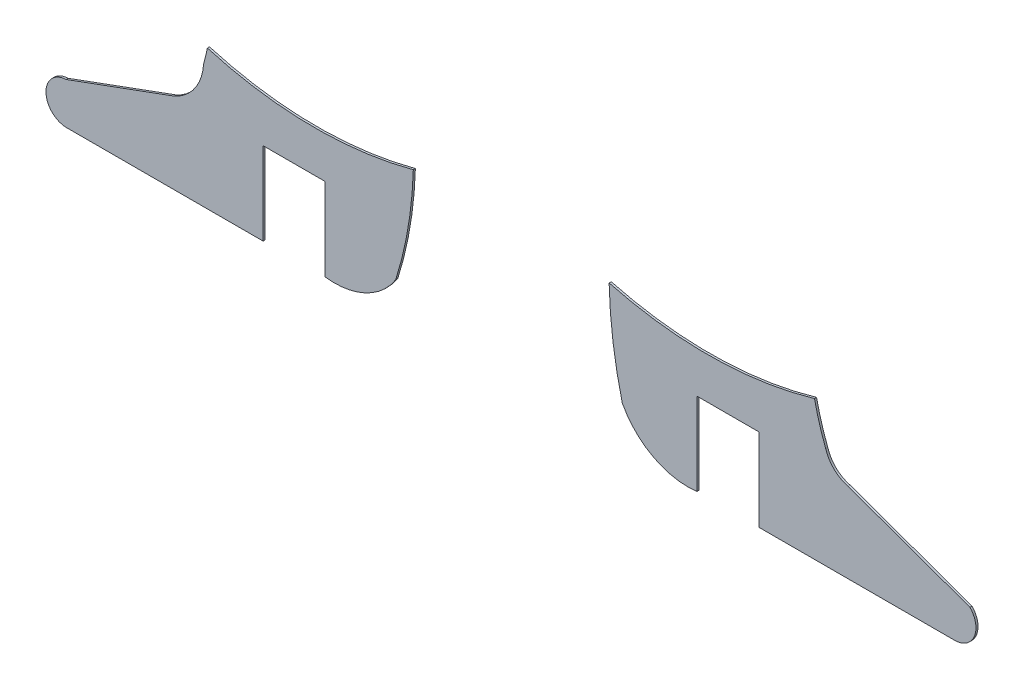
ISO-10303-21;
HEADER;
FILE_DESCRIPTION(('STEP AP214'),'2;1');
FILE_NAME('part.step','',(''),(''),'','','');
FILE_SCHEMA(('AUTOMOTIVE_DESIGN { 1 0 10303 214 1 1 1 1 }'));
ENDSEC;
DATA;
#1=APPLICATION_CONTEXT('core data for automotive mechanical design processes');
#2=APPLICATION_PROTOCOL_DEFINITION('international standard','automotive_design',2000,#1);
#3=PRODUCT_CONTEXT('',#1,'mechanical');
#4=PRODUCT('Part','Part','',(#3));
#5=PRODUCT_RELATED_PRODUCT_CATEGORY('part','',(#4));
#6=PRODUCT_DEFINITION_FORMATION('','',#4);
#7=PRODUCT_DEFINITION_CONTEXT('part definition',#1,'design');
#8=PRODUCT_DEFINITION('design','',#6,#7);
#9=PRODUCT_DEFINITION_SHAPE('','',#8);
#10=(LENGTH_UNIT() NAMED_UNIT(*) SI_UNIT(.MILLI.,.METRE.));
#11=(NAMED_UNIT(*) PLANE_ANGLE_UNIT() SI_UNIT($,.RADIAN.));
#12=(NAMED_UNIT(*) SI_UNIT($,.STERADIAN.) SOLID_ANGLE_UNIT());
#13=UNCERTAINTY_MEASURE_WITH_UNIT(LENGTH_MEASURE(1.E-05),#10,'distance_accuracy_value','');
#14=(GEOMETRIC_REPRESENTATION_CONTEXT(3) GLOBAL_UNCERTAINTY_ASSIGNED_CONTEXT((#13)) GLOBAL_UNIT_ASSIGNED_CONTEXT((#10,
#11,#12)) REPRESENTATION_CONTEXT('',''));
#15=CARTESIAN_POINT('',(0.,0.,0.));
#16=DIRECTION('',(0.,0.,1.));
#17=DIRECTION('',(1.,0.,0.));
#18=AXIS2_PLACEMENT_3D('',#15,#16,#17);
#19=CARTESIAN_POINT('',(83.8690290709745,20.8495485557272,0.1));
#20=DIRECTION('',(0.,0.,-1.));
#21=DIRECTION('',(-1.,0.,0.));
#22=AXIS2_PLACEMENT_3D('',#19,#20,#21);
#23=CYLINDRICAL_SURFACE('',#22,12.4573303817105);
#24=CARTESIAN_POINT('',(83.8690290709745,20.8495485557272,0.));
#25=DIRECTION('',(0.,0.,-1.));
#26=DIRECTION('',(1.,0.,0.));
#27=AXIS2_PLACEMENT_3D('',#24,#25,#26);
#28=CIRCLE('',#27,12.4573303817105);
#29=CARTESIAN_POINT('',(72.2341393791567,16.3982091956784,0.));
#30=VERTEX_POINT('',#29);
#31=CARTESIAN_POINT('',(71.6914335518957,18.2244299654919,0.));
#32=VERTEX_POINT('',#31);
#33=EDGE_CURVE('E157',#30,#32,#28,.T.);
#34=ORIENTED_EDGE('',*,*,#33,.T.);
#35=DIRECTION('',(0.,0.,-1.));
#36=VECTOR('',#35,1.);
#37=CARTESIAN_POINT('',(71.6914335518957,18.2244299654919,0.1));
#38=LINE('',#37,#36);
#39=CARTESIAN_POINT('',(71.6914335518957,18.2244299654919,0.1));
#40=VERTEX_POINT('',#39);
#41=EDGE_CURVE('E12',#40,#32,#38,.T.);
#42=ORIENTED_EDGE('',*,*,#41,.F.);
#43=CARTESIAN_POINT('',(83.8690290709745,20.8495485557272,0.1));
#44=DIRECTION('',(0.,0.,-1.));
#45=DIRECTION('',(1.,0.,0.));
#46=AXIS2_PLACEMENT_3D('',#43,#44,#45);
#47=CIRCLE('',#46,12.4573303817105);
#48=CARTESIAN_POINT('',(72.2341393791567,16.3982091956784,0.1));
#49=VERTEX_POINT('',#48);
#50=EDGE_CURVE('E177',#49,#40,#47,.T.);
#51=ORIENTED_EDGE('',*,*,#50,.F.);
#52=DIRECTION('',(0.,0.,-1.));
#53=VECTOR('',#52,1.);
#54=CARTESIAN_POINT('',(72.2341393791567,16.3982091956784,0.1));
#55=LINE('',#54,#53);
#56=EDGE_CURVE('E153',#49,#30,#55,.T.);
#57=ORIENTED_EDGE('',*,*,#56,.T.);
#58=EDGE_LOOP('',(#34,#42,#51,#57));
#59=FACE_BOUND('',#58,.T.);
#60=ADVANCED_FACE('F43',(#59),#23,.F.);
#61=CARTESIAN_POINT('',(66.5013865734847,35.9814965126974,0.1));
#62=DIRECTION('',(0.,0.,-1.));
#63=DIRECTION('',(-1.,0.,0.));
#64=AXIS2_PLACEMENT_3D('',#61,#62,#63);
#65=CYLINDRICAL_SURFACE('',#64,18.4999999999999);
#66=CARTESIAN_POINT('',(66.5013865734847,35.9814965126974,0.));
#67=DIRECTION('',(0.,0.,-1.));
#68=DIRECTION('',(1.,0.,0.));
#69=AXIS2_PLACEMENT_3D('',#66,#67,#68);
#70=CIRCLE('',#69,18.4999999999999);
#71=CARTESIAN_POINT('',(61.7511875133705,18.1017423508168,0.));
#72=VERTEX_POINT('',#71);
#73=EDGE_CURVE('E160',#32,#72,#70,.T.);
#74=ORIENTED_EDGE('',*,*,#73,.T.);
#75=DIRECTION('',(0.,0.,-1.));
#76=VECTOR('',#75,1.);
#77=CARTESIAN_POINT('',(61.7511875133705,18.1017423508168,0.1));
#78=LINE('',#77,#76);
#79=CARTESIAN_POINT('',(61.7511875133705,18.1017423508168,0.1));
#80=VERTEX_POINT('',#79);
#81=EDGE_CURVE('E51',#80,#72,#78,.T.);
#82=ORIENTED_EDGE('',*,*,#81,.F.);
#83=CARTESIAN_POINT('',(66.5013865734847,35.9814965126974,0.1));
#84=DIRECTION('',(0.,0.,-1.));
#85=DIRECTION('',(1.,0.,0.));
#86=AXIS2_PLACEMENT_3D('',#83,#84,#85);
#87=CIRCLE('',#86,18.4999999999999);
#88=EDGE_CURVE('E111',#40,#80,#87,.T.);
#89=ORIENTED_EDGE('',*,*,#88,.F.);
#90=ORIENTED_EDGE('',*,*,#41,.T.);
#91=EDGE_LOOP('',(#74,#82,#89,#90));
#92=FACE_BOUND('',#91,.T.);
#93=ADVANCED_FACE('F249',(#92),#65,.F.);
#94=CARTESIAN_POINT('',(83.1721964305058,18.5925598102936,0.1));
#95=DIRECTION('',(0.,0.,-1.));
#96=DIRECTION('',(-1.,0.,0.));
#97=AXIS2_PLACEMENT_3D('',#94,#95,#96);
#98=CYLINDRICAL_SURFACE('',#97,21.4266312052669);
#99=CARTESIAN_POINT('',(83.1721964305058,18.5925598102936,0.));
#100=DIRECTION('',(0.,0.,1.));
#101=DIRECTION('',(1.,0.,0.));
#102=AXIS2_PLACEMENT_3D('',#99,#100,#101);
#103=CIRCLE('',#102,21.4266312052669);
#104=CARTESIAN_POINT('',(62.3891769458998,13.3803984631168,0.));
#105=VERTEX_POINT('',#104);
#106=EDGE_CURVE('E162',#72,#105,#103,.T.);
#107=ORIENTED_EDGE('',*,*,#106,.T.);
#108=DIRECTION('',(0.,0.,-1.));
#109=VECTOR('',#108,1.);
#110=CARTESIAN_POINT('',(62.3891769458998,13.3803984631168,0.1));
#111=LINE('',#110,#109);
#112=CARTESIAN_POINT('',(62.3891769458998,13.3803984631168,0.1));
#113=VERTEX_POINT('',#112);
#114=EDGE_CURVE('E193',#113,#105,#111,.T.);
#115=ORIENTED_EDGE('',*,*,#114,.F.);
#116=CARTESIAN_POINT('',(83.1721964305058,18.5925598102936,0.1));
#117=DIRECTION('',(0.,0.,1.));
#118=DIRECTION('',(1.,0.,0.));
#119=AXIS2_PLACEMENT_3D('',#116,#117,#118);
#120=CIRCLE('',#119,21.4266312052669);
#121=EDGE_CURVE('E201',#80,#113,#120,.T.);
#122=ORIENTED_EDGE('',*,*,#121,.F.);
#123=ORIENTED_EDGE('',*,*,#81,.T.);
#124=EDGE_LOOP('',(#107,#115,#122,#123));
#125=FACE_BOUND('',#124,.T.);
#126=ADVANCED_FACE('F199',(#125),#98,.T.);
#127=CARTESIAN_POINT('',(65.57414983765,15.0541987760635,0.1));
#128=DIRECTION('',(0.,0.,-1.));
#129=DIRECTION('',(-1.,0.,0.));
#130=AXIS2_PLACEMENT_3D('',#127,#128,#129);
#131=CYLINDRICAL_SURFACE('',#130,3.59800775552313);
#132=CARTESIAN_POINT('',(65.57414983765,15.0541987760635,0.));
#133=DIRECTION('',(0.,0.,1.));
#134=DIRECTION('',(1.,0.,0.));
#135=AXIS2_PLACEMENT_3D('',#132,#133,#134);
#136=CIRCLE('',#135,3.59800775552313);
#137=CARTESIAN_POINT('',(66.0001291166568,11.4814965126974,0.));
#138=VERTEX_POINT('',#137);
#139=EDGE_CURVE('E164',#105,#138,#136,.T.);
#140=ORIENTED_EDGE('',*,*,#139,.T.);
#141=DIRECTION('',(0.,0.,-1.));
#142=VECTOR('',#141,1.);
#143=CARTESIAN_POINT('',(66.0001291166568,11.4814965126974,0.1));
#144=LINE('',#143,#142);
#145=CARTESIAN_POINT('',(66.0001291166568,11.4814965126974,0.1));
#146=VERTEX_POINT('',#145);
#147=EDGE_CURVE('E190',#146,#138,#144,.T.);
#148=ORIENTED_EDGE('',*,*,#147,.F.);
#149=CARTESIAN_POINT('',(65.57414983765,15.0541987760635,0.1));
#150=DIRECTION('',(0.,0.,1.));
#151=DIRECTION('',(1.,0.,0.));
#152=AXIS2_PLACEMENT_3D('',#149,#150,#151);
#153=CIRCLE('',#152,3.59800775552313);
#154=EDGE_CURVE('E219',#113,#146,#153,.T.);
#155=ORIENTED_EDGE('',*,*,#154,.F.);
#156=ORIENTED_EDGE('',*,*,#114,.T.);
#157=EDGE_LOOP('',(#140,#148,#155,#156));
#158=FACE_BOUND('',#157,.T.);
#159=ADVANCED_FACE('F210',(#158),#131,.T.);
#160=CARTESIAN_POINT('',(66.0001291166569,15.4814965126974,0.1));
#161=DIRECTION('',(-1.,0.,0.));
#162=DIRECTION('',(0.,-1.,0.));
#163=AXIS2_PLACEMENT_3D('',#160,#161,#162);
#164=PLANE('',#163);
#165=DIRECTION('',(0.,1.,0.));
#166=VECTOR('',#165,1.);
#167=CARTESIAN_POINT('',(66.0001291166569,15.4814965126974,0.));
#168=LINE('',#167,#166);
#169=CARTESIAN_POINT('',(66.0001291166569,15.4814965126974,0.));
#170=VERTEX_POINT('',#169);
#171=EDGE_CURVE('E166',#138,#170,#168,.T.);
#172=ORIENTED_EDGE('',*,*,#171,.T.);
#173=DIRECTION('',(0.,0.,-1.));
#174=VECTOR('',#173,1.);
#175=CARTESIAN_POINT('',(66.0001291166569,15.4814965126974,0.1));
#176=LINE('',#175,#174);
#177=CARTESIAN_POINT('',(66.0001291166569,15.4814965126974,0.1));
#178=VERTEX_POINT('',#177);
#179=EDGE_CURVE('E187',#178,#170,#176,.T.);
#180=ORIENTED_EDGE('',*,*,#179,.F.);
#181=DIRECTION('',(0.,1.,0.));
#182=VECTOR('',#181,1.);
#183=CARTESIAN_POINT('',(66.0001291166569,15.4814965126974,0.1));
#184=LINE('',#183,#182);
#185=EDGE_CURVE('E216',#146,#178,#184,.T.);
#186=ORIENTED_EDGE('',*,*,#185,.F.);
#187=ORIENTED_EDGE('',*,*,#147,.T.);
#188=EDGE_LOOP('',(#172,#180,#186,#187));
#189=FACE_BOUND('',#188,.T.);
#190=ADVANCED_FACE('F214',(#189),#164,.F.);
#191=CARTESIAN_POINT('',(69.0001291166569,15.4814965126974,0.1));
#192=DIRECTION('',(0.,1.,0.));
#193=DIRECTION('',(0.,0.,1.));
#194=AXIS2_PLACEMENT_3D('',#191,#192,#193);
#195=PLANE('',#194);
#196=DIRECTION('',(1.,0.,0.));
#197=VECTOR('',#196,1.);
#198=CARTESIAN_POINT('',(69.0001291166569,15.4814965126974,0.));
#199=LINE('',#198,#197);
#200=CARTESIAN_POINT('',(69.0001291166569,15.4814965126974,0.));
#201=VERTEX_POINT('',#200);
#202=EDGE_CURVE('E168',#170,#201,#199,.T.);
#203=ORIENTED_EDGE('',*,*,#202,.T.);
#204=DIRECTION('',(0.,0.,-1.));
#205=VECTOR('',#204,1.);
#206=CARTESIAN_POINT('',(69.0001291166569,15.4814965126974,0.1));
#207=LINE('',#206,#205);
#208=CARTESIAN_POINT('',(69.0001291166569,15.4814965126974,0.1));
#209=VERTEX_POINT('',#208);
#210=EDGE_CURVE('E184',#209,#201,#207,.T.);
#211=ORIENTED_EDGE('',*,*,#210,.F.);
#212=DIRECTION('',(1.,0.,0.));
#213=VECTOR('',#212,1.);
#214=CARTESIAN_POINT('',(69.0001291166569,15.4814965126974,0.1));
#215=LINE('',#214,#213);
#216=EDGE_CURVE('E218',#178,#209,#215,.T.);
#217=ORIENTED_EDGE('',*,*,#216,.F.);
#218=ORIENTED_EDGE('',*,*,#179,.T.);
#219=EDGE_LOOP('',(#203,#211,#217,#218));
#220=FACE_BOUND('',#219,.T.);
#221=ADVANCED_FACE('F262',(#220),#195,.F.);
#222=CARTESIAN_POINT('',(69.0001291166569,11.4814965126974,0.1));
#223=DIRECTION('',(1.,0.,0.));
#224=DIRECTION('',(0.,0.,-1.));
#225=AXIS2_PLACEMENT_3D('',#222,#223,#224);
#226=PLANE('',#225);
#227=DIRECTION('',(0.,-1.,0.));
#228=VECTOR('',#227,1.);
#229=CARTESIAN_POINT('',(69.0001291166569,11.4814965126974,0.));
#230=LINE('',#229,#228);
#231=CARTESIAN_POINT('',(69.0001291166569,11.4814965126974,0.));
#232=VERTEX_POINT('',#231);
#233=EDGE_CURVE('E170',#201,#232,#230,.T.);
#234=ORIENTED_EDGE('',*,*,#233,.T.);
#235=DIRECTION('',(0.,0.,-1.));
#236=VECTOR('',#235,1.);
#237=CARTESIAN_POINT('',(69.0001291166569,11.4814965126974,0.1));
#238=LINE('',#237,#236);
#239=CARTESIAN_POINT('',(69.0001291166569,11.4814965126974,0.1));
#240=VERTEX_POINT('',#239);
#241=EDGE_CURVE('E181',#240,#232,#238,.T.);
#242=ORIENTED_EDGE('',*,*,#241,.F.);
#243=DIRECTION('',(0.,-1.,0.));
#244=VECTOR('',#243,1.);
#245=CARTESIAN_POINT('',(69.0001291166569,11.4814965126974,0.1));
#246=LINE('',#245,#244);
#247=EDGE_CURVE('E221',#209,#240,#246,.T.);
#248=ORIENTED_EDGE('',*,*,#247,.F.);
#249=ORIENTED_EDGE('',*,*,#210,.T.);
#250=EDGE_LOOP('',(#234,#242,#248,#249));
#251=FACE_BOUND('',#250,.T.);
#252=ADVANCED_FACE('F230',(#251),#226,.F.);
#253=CARTESIAN_POINT('',(78.5371342914384,11.4818978119905,0.1));
#254=DIRECTION('',(-4.20781246713338E-05,0.999999999114716,0.));
#255=DIRECTION('',(-0.999999999114716,-4.20781246713338E-05,0.));
#256=AXIS2_PLACEMENT_3D('',#253,#254,#255);
#257=PLANE('',#256);
#258=DIRECTION('',(0.999999999114716,4.20781246713338E-05,0.));
#259=VECTOR('',#258,1.);
#260=CARTESIAN_POINT('',(78.5371342914384,11.4818978119905,0.));
#261=LINE('',#260,#259);
#262=CARTESIAN_POINT('',(78.5371342914384,11.4818978119905,0.));
#263=VERTEX_POINT('',#262);
#264=EDGE_CURVE('E172',#232,#263,#261,.T.);
#265=ORIENTED_EDGE('',*,*,#264,.T.);
#266=DIRECTION('',(0.,0.,-1.));
#267=VECTOR('',#266,1.);
#268=CARTESIAN_POINT('',(78.5371342914384,11.4818978119905,0.1));
#269=LINE('',#268,#267);
#270=CARTESIAN_POINT('',(78.5371342914384,11.4818978119905,0.1));
#271=VERTEX_POINT('',#270);
#272=EDGE_CURVE('E148',#271,#263,#269,.T.);
#273=ORIENTED_EDGE('',*,*,#272,.F.);
#274=DIRECTION('',(0.999999999114716,4.20781246713338E-05,0.));
#275=VECTOR('',#274,1.);
#276=CARTESIAN_POINT('',(78.5371342914384,11.4818978119905,0.1));
#277=LINE('',#276,#275);
#278=EDGE_CURVE('E139',#240,#271,#277,.T.);
#279=ORIENTED_EDGE('',*,*,#278,.F.);
#280=ORIENTED_EDGE('',*,*,#241,.T.);
#281=EDGE_LOOP('',(#265,#273,#279,#280));
#282=FACE_BOUND('',#281,.T.);
#283=ADVANCED_FACE('F234',(#282),#257,.F.);
#284=CARTESIAN_POINT('',(78.4684159839539,12.5190742196874,0.1));
#285=DIRECTION('',(0.,0.,-1.));
#286=DIRECTION('',(-1.,0.,0.));
#287=AXIS2_PLACEMENT_3D('',#284,#285,#286);
#288=CYLINDRICAL_SURFACE('',#287,1.03945038672686);
#289=CARTESIAN_POINT('',(78.4684159839539,12.5190742196874,0.));
#290=DIRECTION('',(0.,0.,1.));
#291=DIRECTION('',(1.,0.,0.));
#292=AXIS2_PLACEMENT_3D('',#289,#290,#291);
#293=CIRCLE('',#292,1.03945038672686);
#294=CARTESIAN_POINT('',(79.2203813442728,13.2367128497423,0.));
#295=VERTEX_POINT('',#294);
#296=EDGE_CURVE('E147',#263,#295,#293,.T.);
#297=ORIENTED_EDGE('',*,*,#296,.T.);
#298=DIRECTION('',(0.,0.,-1.));
#299=VECTOR('',#298,1.);
#300=CARTESIAN_POINT('',(79.2203813442728,13.2367128497423,0.1));
#301=LINE('',#300,#299);
#302=CARTESIAN_POINT('',(79.2203813442728,13.2367128497423,0.1));
#303=VERTEX_POINT('',#302);
#304=EDGE_CURVE('E144',#303,#295,#301,.T.);
#305=ORIENTED_EDGE('',*,*,#304,.F.);
#306=CARTESIAN_POINT('',(78.4684159839539,12.5190742196874,0.1));
#307=DIRECTION('',(0.,0.,1.));
#308=DIRECTION('',(1.,0.,0.));
#309=AXIS2_PLACEMENT_3D('',#306,#307,#308);
#310=CIRCLE('',#309,1.03945038672686);
#311=EDGE_CURVE('E133',#271,#303,#310,.T.);
#312=ORIENTED_EDGE('',*,*,#311,.F.);
#313=ORIENTED_EDGE('',*,*,#272,.T.);
#314=EDGE_LOOP('',(#297,#305,#312,#313));
#315=FACE_BOUND('',#314,.T.);
#316=ADVANCED_FACE('F145',(#315),#288,.T.);
#317=CARTESIAN_POINT('',(73.3210588574965,15.3574587346766,0.1));
#318=DIRECTION('',(-0.338294346275011,-0.941040347316927,0.));
#319=DIRECTION('',(0.941040347316927,-0.338294346275011,0.));
#320=AXIS2_PLACEMENT_3D('',#317,#318,#319);
#321=PLANE('',#320);
#322=DIRECTION('',(-0.941040347316927,0.338294346275011,0.));
#323=VECTOR('',#322,1.);
#324=CARTESIAN_POINT('',(73.3210588574965,15.3574587346766,0.));
#325=LINE('',#324,#323);
#326=CARTESIAN_POINT('',(73.3210588574965,15.3574587346766,0.));
#327=VERTEX_POINT('',#326);
#328=EDGE_CURVE('E97',#295,#327,#325,.T.);
#329=ORIENTED_EDGE('',*,*,#328,.T.);
#330=DIRECTION('',(0.,0.,-1.));
#331=VECTOR('',#330,1.);
#332=CARTESIAN_POINT('',(73.3210588574965,15.3574587346766,0.1));
#333=LINE('',#332,#331);
#334=CARTESIAN_POINT('',(73.3210588574965,15.3574587346766,0.1));
#335=VERTEX_POINT('',#334);
#336=EDGE_CURVE('E149',#335,#327,#333,.T.);
#337=ORIENTED_EDGE('',*,*,#336,.F.);
#338=DIRECTION('',(-0.941040347316927,0.338294346275011,0.));
#339=VECTOR('',#338,1.);
#340=CARTESIAN_POINT('',(73.3210588574965,15.3574587346766,0.1));
#341=LINE('',#340,#339);
#342=EDGE_CURVE('E137',#303,#335,#341,.T.);
#343=ORIENTED_EDGE('',*,*,#342,.F.);
#344=ORIENTED_EDGE('',*,*,#304,.T.);
#345=EDGE_LOOP('',(#329,#337,#343,#344));
#346=FACE_BOUND('',#345,.T.);
#347=ADVANCED_FACE('F151',(#346),#321,.F.);
#348=CARTESIAN_POINT('',(73.7021720657947,16.8434221473645,0.1));
#349=DIRECTION('',(0.,0.,-1.));
#350=DIRECTION('',(-1.,0.,0.));
#351=AXIS2_PLACEMENT_3D('',#348,#349,#350);
#352=CYLINDRICAL_SURFACE('',#351,1.53405819361144);
#353=CARTESIAN_POINT('',(73.7021720657947,16.8434221473645,0.));
#354=DIRECTION('',(0.,0.,-1.));
#355=DIRECTION('',(1.,0.,0.));
#356=AXIS2_PLACEMENT_3D('',#353,#354,#355);
#357=CIRCLE('',#356,1.53405819361144);
#358=EDGE_CURVE('E103',#327,#30,#357,.T.);
#359=ORIENTED_EDGE('',*,*,#358,.T.);
#360=ORIENTED_EDGE('',*,*,#56,.F.);
#361=CARTESIAN_POINT('',(73.7021720657947,16.8434221473645,0.1));
#362=DIRECTION('',(0.,0.,-1.));
#363=DIRECTION('',(1.,0.,0.));
#364=AXIS2_PLACEMENT_3D('',#361,#362,#363);
#365=CIRCLE('',#364,1.53405819361144);
#366=EDGE_CURVE('E59',#335,#49,#365,.T.);
#367=ORIENTED_EDGE('',*,*,#366,.F.);
#368=ORIENTED_EDGE('',*,*,#336,.T.);
#369=EDGE_LOOP('',(#359,#360,#367,#368));
#370=FACE_BOUND('',#369,.T.);
#371=ADVANCED_FACE('F238',(#370),#352,.F.);
#372=CARTESIAN_POINT('',(83.8690290709745,20.8495485557272,0.1));
#373=DIRECTION('',(0.,0.,1.));
#374=DIRECTION('',(1.,0.,0.));
#375=AXIS2_PLACEMENT_3D('',#372,#373,#374);
#376=PLANE('',#375);
#377=ORIENTED_EDGE('',*,*,#50,.T.);
#378=ORIENTED_EDGE('',*,*,#88,.T.);
#379=ORIENTED_EDGE('',*,*,#121,.T.);
#380=ORIENTED_EDGE('',*,*,#154,.T.);
#381=ORIENTED_EDGE('',*,*,#185,.T.);
#382=ORIENTED_EDGE('',*,*,#216,.T.);
#383=ORIENTED_EDGE('',*,*,#247,.T.);
#384=ORIENTED_EDGE('',*,*,#278,.T.);
#385=ORIENTED_EDGE('',*,*,#311,.T.);
#386=ORIENTED_EDGE('',*,*,#342,.T.);
#387=ORIENTED_EDGE('',*,*,#366,.T.);
#388=EDGE_LOOP('',(#377,#378,#379,#380,#381,#382,#383,#384,#385,#386,#387));
#389=FACE_BOUND('',#388,.T.);
#390=ADVANCED_FACE('F135',(#389),#376,.T.);
#391=CARTESIAN_POINT('',(83.8690290709745,20.8495485557272,0.));
#392=DIRECTION('',(0.,0.,1.));
#393=DIRECTION('',(1.,0.,0.));
#394=AXIS2_PLACEMENT_3D('',#391,#392,#393);
#395=PLANE('',#394);
#396=ORIENTED_EDGE('',*,*,#33,.F.);
#397=ORIENTED_EDGE('',*,*,#358,.F.);
#398=ORIENTED_EDGE('',*,*,#328,.F.);
#399=ORIENTED_EDGE('',*,*,#296,.F.);
#400=ORIENTED_EDGE('',*,*,#264,.F.);
#401=ORIENTED_EDGE('',*,*,#233,.F.);
#402=ORIENTED_EDGE('',*,*,#202,.F.);
#403=ORIENTED_EDGE('',*,*,#171,.F.);
#404=ORIENTED_EDGE('',*,*,#139,.F.);
#405=ORIENTED_EDGE('',*,*,#106,.F.);
#406=ORIENTED_EDGE('',*,*,#73,.F.);
#407=EDGE_LOOP('',(#396,#397,#398,#399,#400,#401,#402,#403,#404,#405,#406));
#408=FACE_BOUND('',#407,.T.);
#409=ADVANCED_FACE('F205',(#408),#395,.F.);
#410=CLOSED_SHELL('',(#60,#93,#126,#159,#190,#221,#252,#283,#316,#347,#371,#390,#409));
#411=MANIFOLD_SOLID_BREP('B2',#410);
#412=CARTESIAN_POINT('',(48.4656722786271,14.9584738850332,0.1));
#413=DIRECTION('',(0.,0.,-1.));
#414=DIRECTION('',(-1.,0.,0.));
#415=AXIS2_PLACEMENT_3D('',#412,#413,#414);
#416=CYLINDRICAL_SURFACE('',#415,3.50774536929648);
#417=CARTESIAN_POINT('',(48.4656722786271,14.9584738850332,0.));
#418=DIRECTION('',(0.,0.,1.));
#419=DIRECTION('',(1.,0.,0.));
#420=AXIS2_PLACEMENT_3D('',#417,#418,#419);
#421=CIRCLE('',#420,3.50774536929648);
#422=CARTESIAN_POINT('',(48.0049113265582,11.4811218866198,0.));
#423=VERTEX_POINT('',#422);
#424=CARTESIAN_POINT('',(51.4198289551434,13.0671156676625,0.));
#425=VERTEX_POINT('',#424);
#426=EDGE_CURVE('E463',#423,#425,#421,.T.);
#427=ORIENTED_EDGE('',*,*,#426,.T.);
#428=DIRECTION('',(0.,0.,-1.));
#429=VECTOR('',#428,1.);
#430=CARTESIAN_POINT('',(51.4198289551434,13.0671156676625,0.1));
#431=LINE('',#430,#429);
#432=CARTESIAN_POINT('',(51.4198289551434,13.0671156676625,0.1));
#433=VERTEX_POINT('',#432);
#434=EDGE_CURVE('E41',#433,#425,#431,.T.);
#435=ORIENTED_EDGE('',*,*,#434,.F.);
#436=CARTESIAN_POINT('',(48.4656722786271,14.9584738850332,0.1));
#437=DIRECTION('',(0.,0.,1.));
#438=DIRECTION('',(1.,0.,0.));
#439=AXIS2_PLACEMENT_3D('',#436,#437,#438);
#440=CIRCLE('',#439,3.50774536929648);
#441=CARTESIAN_POINT('',(48.0049113265582,11.4811218866198,0.1));
#442=VERTEX_POINT('',#441);
#443=EDGE_CURVE('E483',#442,#433,#440,.T.);
#444=ORIENTED_EDGE('',*,*,#443,.F.);
#445=DIRECTION('',(0.,0.,-1.));
#446=VECTOR('',#445,1.);
#447=CARTESIAN_POINT('',(48.0049113265582,11.4811218866198,0.1));
#448=LINE('',#447,#446);
#449=EDGE_CURVE('E459',#442,#423,#448,.T.);
#450=ORIENTED_EDGE('',*,*,#449,.T.);
#451=EDGE_LOOP('',(#427,#435,#444,#450));
#452=FACE_BOUND('',#451,.T.);
#453=ADVANCED_FACE('F349',(#452),#416,.T.);
#454=CARTESIAN_POINT('',(33.7593765359492,18.6478987323557,0.1));
#455=DIRECTION('',(0.,0.,-1.));
#456=DIRECTION('',(-1.,0.,0.));
#457=AXIS2_PLACEMENT_3D('',#454,#455,#456);
#458=CYLINDRICAL_SURFACE('',#457,18.5212504779183);
#459=CARTESIAN_POINT('',(33.7593765359492,18.6478987323557,0.));
#460=DIRECTION('',(0.,0.,1.));
#461=DIRECTION('',(1.,0.,0.));
#462=AXIS2_PLACEMENT_3D('',#459,#460,#461);
#463=CIRCLE('',#462,18.5212504779183);
#464=CARTESIAN_POINT('',(52.2727577775067,18.1080522073756,0.));
#465=VERTEX_POINT('',#464);
#466=EDGE_CURVE('E466',#425,#465,#463,.T.);
#467=ORIENTED_EDGE('',*,*,#466,.T.);
#468=DIRECTION('',(0.,0.,-1.));
#469=VECTOR('',#468,1.);
#470=CARTESIAN_POINT('',(52.2727577775067,18.1080522073756,0.1));
#471=LINE('',#470,#469);
#472=CARTESIAN_POINT('',(52.2727577775067,18.1080522073756,0.1));
#473=VERTEX_POINT('',#472);
#474=EDGE_CURVE('E357',#473,#465,#471,.T.);
#475=ORIENTED_EDGE('',*,*,#474,.F.);
#476=CARTESIAN_POINT('',(33.7593765359492,18.6478987323557,0.1));
#477=DIRECTION('',(0.,0.,1.));
#478=DIRECTION('',(1.,0.,0.));
#479=AXIS2_PLACEMENT_3D('',#476,#477,#478);
#480=CIRCLE('',#479,18.5212504779183);
#481=EDGE_CURVE('E417',#433,#473,#480,.T.);
#482=ORIENTED_EDGE('',*,*,#481,.F.);
#483=ORIENTED_EDGE('',*,*,#434,.T.);
#484=EDGE_LOOP('',(#467,#475,#482,#483));
#485=FACE_BOUND('',#484,.T.);
#486=ADVANCED_FACE('F555',(#485),#458,.T.);
#487=CARTESIAN_POINT('',(47.498871659829,35.9814965126974,0.1));
#488=DIRECTION('',(0.,0.,-1.));
#489=DIRECTION('',(-1.,0.,0.));
#490=AXIS2_PLACEMENT_3D('',#487,#488,#489);
#491=CYLINDRICAL_SURFACE('',#490,18.5);
#492=CARTESIAN_POINT('',(47.498871659829,35.9814965126974,0.));
#493=DIRECTION('',(0.,0.,-1.));
#494=DIRECTION('',(1.,0.,0.));
#495=AXIS2_PLACEMENT_3D('',#492,#493,#494);
#496=CIRCLE('',#495,18.5);
#497=CARTESIAN_POINT('',(42.304716771943,18.225631143737,0.));
#498=VERTEX_POINT('',#497);
#499=EDGE_CURVE('E468',#465,#498,#496,.T.);
#500=ORIENTED_EDGE('',*,*,#499,.T.);
#501=DIRECTION('',(0.,0.,-1.));
#502=VECTOR('',#501,1.);
#503=CARTESIAN_POINT('',(42.304716771943,18.225631143737,0.1));
#504=LINE('',#503,#502);
#505=CARTESIAN_POINT('',(42.304716771943,18.225631143737,0.1));
#506=VERTEX_POINT('',#505);
#507=EDGE_CURVE('E499',#506,#498,#504,.T.);
#508=ORIENTED_EDGE('',*,*,#507,.F.);
#509=CARTESIAN_POINT('',(47.498871659829,35.9814965126974,0.1));
#510=DIRECTION('',(0.,0.,-1.));
#511=DIRECTION('',(1.,0.,0.));
#512=AXIS2_PLACEMENT_3D('',#509,#510,#511);
#513=CIRCLE('',#512,18.5);
#514=EDGE_CURVE('E507',#473,#506,#513,.T.);
#515=ORIENTED_EDGE('',*,*,#514,.F.);
#516=ORIENTED_EDGE('',*,*,#474,.T.);
#517=EDGE_LOOP('',(#500,#508,#515,#516));
#518=FACE_BOUND('',#517,.T.);
#519=ADVANCED_FACE('F505',(#518),#491,.F.);
#520=CARTESIAN_POINT('',(29.3406516039204,20.937759405113,0.1));
#521=DIRECTION('',(0.,0.,-1.));
#522=DIRECTION('',(-1.,0.,0.));
#523=AXIS2_PLACEMENT_3D('',#520,#521,#522);
#524=CYLINDRICAL_SURFACE('',#523,13.2447206609611);
#525=CARTESIAN_POINT('',(29.3406516039204,20.937759405113,0.));
#526=DIRECTION('',(0.,0.,-1.));
#527=DIRECTION('',(1.,0.,0.));
#528=AXIS2_PLACEMENT_3D('',#525,#526,#527);
#529=CIRCLE('',#528,13.2447206609611);
#530=CARTESIAN_POINT('',(42.1204371868106,17.4592962613897,0.));
#531=VERTEX_POINT('',#530);
#532=EDGE_CURVE('E470',#498,#531,#529,.T.);
#533=ORIENTED_EDGE('',*,*,#532,.T.);
#534=DIRECTION('',(0.,0.,-1.));
#535=VECTOR('',#534,1.);
#536=CARTESIAN_POINT('',(42.1204371868106,17.4592962613897,0.1));
#537=LINE('',#536,#535);
#538=CARTESIAN_POINT('',(42.1204371868106,17.4592962613897,0.1));
#539=VERTEX_POINT('',#538);
#540=EDGE_CURVE('E496',#539,#531,#537,.T.);
#541=ORIENTED_EDGE('',*,*,#540,.F.);
#542=CARTESIAN_POINT('',(29.3406516039204,20.937759405113,0.1));
#543=DIRECTION('',(0.,0.,-1.));
#544=DIRECTION('',(1.,0.,0.));
#545=AXIS2_PLACEMENT_3D('',#542,#543,#544);
#546=CIRCLE('',#545,13.2447206609611);
#547=EDGE_CURVE('E525',#506,#539,#546,.T.);
#548=ORIENTED_EDGE('',*,*,#547,.F.);
#549=ORIENTED_EDGE('',*,*,#507,.T.);
#550=EDGE_LOOP('',(#533,#541,#548,#549));
#551=FACE_BOUND('',#550,.T.);
#552=ADVANCED_FACE('F516',(#551),#524,.F.);
#553=CARTESIAN_POINT('',(39.7291006741755,17.5994410081286,0.1));
#554=DIRECTION('',(0.,0.,-1.));
#555=DIRECTION('',(-1.,0.,0.));
#556=AXIS2_PLACEMENT_3D('',#553,#554,#555);
#557=CYLINDRICAL_SURFACE('',#556,2.39543959779837);
#558=CARTESIAN_POINT('',(39.7291006741755,17.5994410081286,0.));
#559=DIRECTION('',(0.,0.,-1.));
#560=DIRECTION('',(1.,0.,0.));
#561=AXIS2_PLACEMENT_3D('',#558,#559,#560);
#562=CIRCLE('',#561,2.39543959779837);
#563=CARTESIAN_POINT('',(40.6651258065074,15.3944494393594,0.));
#564=VERTEX_POINT('',#563);
#565=EDGE_CURVE('E472',#531,#564,#562,.T.);
#566=ORIENTED_EDGE('',*,*,#565,.T.);
#567=DIRECTION('',(0.,0.,-1.));
#568=VECTOR('',#567,1.);
#569=CARTESIAN_POINT('',(40.6651258065074,15.3944494393594,0.1));
#570=LINE('',#569,#568);
#571=CARTESIAN_POINT('',(40.6651258065074,15.3944494393594,0.1));
#572=VERTEX_POINT('',#571);
#573=EDGE_CURVE('E493',#572,#564,#570,.T.);
#574=ORIENTED_EDGE('',*,*,#573,.F.);
#575=CARTESIAN_POINT('',(39.7291006741755,17.5994410081286,0.1));
#576=DIRECTION('',(0.,0.,-1.));
#577=DIRECTION('',(1.,0.,0.));
#578=AXIS2_PLACEMENT_3D('',#575,#576,#577);
#579=CIRCLE('',#578,2.39543959779837);
#580=EDGE_CURVE('E522',#539,#572,#579,.T.);
#581=ORIENTED_EDGE('',*,*,#580,.F.);
#582=ORIENTED_EDGE('',*,*,#540,.T.);
#583=EDGE_LOOP('',(#566,#574,#581,#582));
#584=FACE_BOUND('',#583,.T.);
#585=ADVANCED_FACE('F520',(#584),#557,.F.);
#586=CARTESIAN_POINT('',(35.4629557097511,13.4856610945572,0.1));
#587=DIRECTION('',(0.344465571501462,-0.938798950814375,0.));
#588=DIRECTION('',(0.938798950814375,0.344465571501462,0.));
#589=AXIS2_PLACEMENT_3D('',#586,#587,#588);
#590=PLANE('',#589);
#591=DIRECTION('',(-0.938798950814375,-0.344465571501462,0.));
#592=VECTOR('',#591,1.);
#593=CARTESIAN_POINT('',(35.4629557097511,13.4856610945572,0.));
#594=LINE('',#593,#592);
#595=CARTESIAN_POINT('',(35.4629557097511,13.4856610945572,0.));
#596=VERTEX_POINT('',#595);
#597=EDGE_CURVE('E474',#564,#596,#594,.T.);
#598=ORIENTED_EDGE('',*,*,#597,.T.);
#599=DIRECTION('',(0.,0.,-1.));
#600=VECTOR('',#599,1.);
#601=CARTESIAN_POINT('',(35.4629557097511,13.4856610945572,0.1));
#602=LINE('',#601,#600);
#603=CARTESIAN_POINT('',(35.4629557097511,13.4856610945572,0.1));
#604=VERTEX_POINT('',#603);
#605=EDGE_CURVE('E490',#604,#596,#602,.T.);
#606=ORIENTED_EDGE('',*,*,#605,.F.);
#607=DIRECTION('',(-0.938798950814375,-0.344465571501462,0.));
#608=VECTOR('',#607,1.);
#609=CARTESIAN_POINT('',(35.4629557097511,13.4856610945572,0.1));
#610=LINE('',#609,#608);
#611=EDGE_CURVE('E524',#572,#604,#610,.T.);
#612=ORIENTED_EDGE('',*,*,#611,.F.);
#613=ORIENTED_EDGE('',*,*,#573,.T.);
#614=EDGE_LOOP('',(#598,#606,#612,#613));
#615=FACE_BOUND('',#614,.T.);
#616=ADVANCED_FACE('F568',(#615),#590,.F.);
#617=CARTESIAN_POINT('',(35.4960875905123,12.4822539814309,0.1));
#618=DIRECTION('',(0.,0.,-1.));
#619=DIRECTION('',(-1.,0.,0.));
#620=AXIS2_PLACEMENT_3D('',#617,#618,#619);
#621=CYLINDRICAL_SURFACE('',#620,1.00395396119307);
#622=CARTESIAN_POINT('',(35.4960875905123,12.4822539814309,0.));
#623=DIRECTION('',(0.,0.,1.));
#624=DIRECTION('',(1.,0.,0.));
#625=AXIS2_PLACEMENT_3D('',#622,#623,#624);
#626=CIRCLE('',#625,1.00395396119307);
#627=CARTESIAN_POINT('',(35.5061690551018,11.4783506393371,0.));
#628=VERTEX_POINT('',#627);
#629=EDGE_CURVE('E476',#596,#628,#626,.T.);
#630=ORIENTED_EDGE('',*,*,#629,.T.);
#631=DIRECTION('',(0.,0.,-1.));
#632=VECTOR('',#631,1.);
#633=CARTESIAN_POINT('',(35.5061690551018,11.4783506393371,0.1));
#634=LINE('',#633,#632);
#635=CARTESIAN_POINT('',(35.5061690551018,11.4783506393371,0.1));
#636=VERTEX_POINT('',#635);
#637=EDGE_CURVE('E487',#636,#628,#634,.T.);
#638=ORIENTED_EDGE('',*,*,#637,.F.);
#639=CARTESIAN_POINT('',(35.4960875905123,12.4822539814309,0.1));
#640=DIRECTION('',(0.,0.,1.));
#641=DIRECTION('',(1.,0.,0.));
#642=AXIS2_PLACEMENT_3D('',#639,#640,#641);
#643=CIRCLE('',#642,1.00395396119307);
#644=EDGE_CURVE('E527',#604,#636,#643,.T.);
#645=ORIENTED_EDGE('',*,*,#644,.F.);
#646=ORIENTED_EDGE('',*,*,#605,.T.);
#647=EDGE_LOOP('',(#630,#638,#645,#646));
#648=FACE_BOUND('',#647,.T.);
#649=ADVANCED_FACE('F536',(#648),#621,.T.);
#650=CARTESIAN_POINT('',(45.004911496558,11.4797407283128,0.1));
#651=DIRECTION('',(-0.000146344526062581,0.99999998929164,0.));
#652=DIRECTION('',(-0.99999998929164,-0.000146344526062581,0.));
#653=AXIS2_PLACEMENT_3D('',#650,#651,#652);
#654=PLANE('',#653);
#655=DIRECTION('',(0.99999998929164,0.000146344526062581,0.));
#656=VECTOR('',#655,1.);
#657=CARTESIAN_POINT('',(45.004911496558,11.4797407283128,0.));
#658=LINE('',#657,#656);
#659=CARTESIAN_POINT('',(45.004911496558,11.4797407283128,0.));
#660=VERTEX_POINT('',#659);
#661=EDGE_CURVE('E478',#628,#660,#658,.T.);
#662=ORIENTED_EDGE('',*,*,#661,.T.);
#663=DIRECTION('',(0.,0.,-1.));
#664=VECTOR('',#663,1.);
#665=CARTESIAN_POINT('',(45.004911496558,11.4797407283128,0.1));
#666=LINE('',#665,#664);
#667=CARTESIAN_POINT('',(45.004911496558,11.4797407283128,0.1));
#668=VERTEX_POINT('',#667);
#669=EDGE_CURVE('E454',#668,#660,#666,.T.);
#670=ORIENTED_EDGE('',*,*,#669,.F.);
#671=DIRECTION('',(0.99999998929164,0.000146344526062581,0.));
#672=VECTOR('',#671,1.);
#673=CARTESIAN_POINT('',(45.004911496558,11.4797407283128,0.1));
#674=LINE('',#673,#672);
#675=EDGE_CURVE('E445',#636,#668,#674,.T.);
#676=ORIENTED_EDGE('',*,*,#675,.F.);
#677=ORIENTED_EDGE('',*,*,#637,.T.);
#678=EDGE_LOOP('',(#662,#670,#676,#677));
#679=FACE_BOUND('',#678,.T.);
#680=ADVANCED_FACE('F540',(#679),#654,.F.);
#681=CARTESIAN_POINT('',(45.0043261184538,15.4797406854794,0.1));
#682=DIRECTION('',(-0.99999998929164,-0.000146344526054734,0.));
#683=DIRECTION('',(0.000146344526054734,-0.99999998929164,0.));
#684=AXIS2_PLACEMENT_3D('',#681,#682,#683);
#685=PLANE('',#684);
#686=DIRECTION('',(-0.000146344526054734,0.99999998929164,0.));
#687=VECTOR('',#686,1.);
#688=CARTESIAN_POINT('',(45.0043261184538,15.4797406854794,0.));
#689=LINE('',#688,#687);
#690=CARTESIAN_POINT('',(45.0043261184538,15.4797406854794,0.));
#691=VERTEX_POINT('',#690);
#692=EDGE_CURVE('E453',#660,#691,#689,.T.);
#693=ORIENTED_EDGE('',*,*,#692,.T.);
#694=DIRECTION('',(0.,0.,-1.));
#695=VECTOR('',#694,1.);
#696=CARTESIAN_POINT('',(45.0043261184538,15.4797406854794,0.1));
#697=LINE('',#696,#695);
#698=CARTESIAN_POINT('',(45.0043261184538,15.4797406854794,0.1));
#699=VERTEX_POINT('',#698);
#700=EDGE_CURVE('E450',#699,#691,#697,.T.);
#701=ORIENTED_EDGE('',*,*,#700,.F.);
#702=DIRECTION('',(-0.000146344526054734,0.99999998929164,0.));
#703=VECTOR('',#702,1.);
#704=CARTESIAN_POINT('',(45.0043261184538,15.4797406854794,0.1));
#705=LINE('',#704,#703);
#706=EDGE_CURVE('E439',#668,#699,#705,.T.);
#707=ORIENTED_EDGE('',*,*,#706,.F.);
#708=ORIENTED_EDGE('',*,*,#669,.T.);
#709=EDGE_LOOP('',(#693,#701,#707,#708));
#710=FACE_BOUND('',#709,.T.);
#711=ADVANCED_FACE('F451',(#710),#685,.F.);
#712=CARTESIAN_POINT('',(48.0001291166568,15.480179104854,0.1));
#713=DIRECTION('',(-0.00014634452606405,0.99999998929164,0.));
#714=DIRECTION('',(-0.99999998929164,-0.00014634452606405,0.));
#715=AXIS2_PLACEMENT_3D('',#712,#713,#714);
#716=PLANE('',#715);
#717=DIRECTION('',(0.99999998929164,0.00014634452606405,0.));
#718=VECTOR('',#717,1.);
#719=CARTESIAN_POINT('',(48.0001291166568,15.480179104854,0.));
#720=LINE('',#719,#718);
#721=CARTESIAN_POINT('',(48.0001291166568,15.480179104854,0.));
#722=VERTEX_POINT('',#721);
#723=EDGE_CURVE('E403',#691,#722,#720,.T.);
#724=ORIENTED_EDGE('',*,*,#723,.T.);
#725=DIRECTION('',(0.,0.,-1.));
#726=VECTOR('',#725,1.);
#727=CARTESIAN_POINT('',(48.0001291166568,15.480179104854,0.1));
#728=LINE('',#727,#726);
#729=CARTESIAN_POINT('',(48.0001291166568,15.480179104854,0.1));
#730=VERTEX_POINT('',#729);
#731=EDGE_CURVE('E455',#730,#722,#728,.T.);
#732=ORIENTED_EDGE('',*,*,#731,.F.);
#733=DIRECTION('',(0.99999998929164,0.00014634452606405,0.));
#734=VECTOR('',#733,1.);
#735=CARTESIAN_POINT('',(48.0001291166568,15.480179104854,0.1));
#736=LINE('',#735,#734);
#737=EDGE_CURVE('E443',#699,#730,#736,.T.);
#738=ORIENTED_EDGE('',*,*,#737,.F.);
#739=ORIENTED_EDGE('',*,*,#700,.T.);
#740=EDGE_LOOP('',(#724,#732,#738,#739));
#741=FACE_BOUND('',#740,.T.);
#742=ADVANCED_FACE('F457',(#741),#716,.F.);
#743=CARTESIAN_POINT('',(48.0049113265582,11.4811218866198,0.1));
#744=DIRECTION('',(0.999999284990897,0.00119583347300443,0.));
#745=DIRECTION('',(-0.00119583347300443,0.999999284990897,0.));
#746=AXIS2_PLACEMENT_3D('',#743,#744,#745);
#747=PLANE('',#746);
#748=DIRECTION('',(0.00119583347300443,-0.999999284990897,0.));
#749=VECTOR('',#748,1.);
#750=CARTESIAN_POINT('',(48.0049113265582,11.4811218866198,0.));
#751=LINE('',#750,#749);
#752=EDGE_CURVE('E409',#722,#423,#751,.T.);
#753=ORIENTED_EDGE('',*,*,#752,.T.);
#754=ORIENTED_EDGE('',*,*,#449,.F.);
#755=DIRECTION('',(0.00119583347300443,-0.999999284990897,0.));
#756=VECTOR('',#755,1.);
#757=CARTESIAN_POINT('',(48.0049113265582,11.4811218866198,0.1));
#758=LINE('',#757,#756);
#759=EDGE_CURVE('E365',#730,#442,#758,.T.);
#760=ORIENTED_EDGE('',*,*,#759,.F.);
#761=ORIENTED_EDGE('',*,*,#731,.T.);
#762=EDGE_LOOP('',(#753,#754,#760,#761));
#763=FACE_BOUND('',#762,.T.);
#764=ADVANCED_FACE('F544',(#763),#747,.F.);
#765=CARTESIAN_POINT('',(48.4656722786271,14.9584738850332,0.1));
#766=DIRECTION('',(0.,0.,1.));
#767=DIRECTION('',(1.,0.,0.));
#768=AXIS2_PLACEMENT_3D('',#765,#766,#767);
#769=PLANE('',#768);
#770=ORIENTED_EDGE('',*,*,#443,.T.);
#771=ORIENTED_EDGE('',*,*,#481,.T.);
#772=ORIENTED_EDGE('',*,*,#514,.T.);
#773=ORIENTED_EDGE('',*,*,#547,.T.);
#774=ORIENTED_EDGE('',*,*,#580,.T.);
#775=ORIENTED_EDGE('',*,*,#611,.T.);
#776=ORIENTED_EDGE('',*,*,#644,.T.);
#777=ORIENTED_EDGE('',*,*,#675,.T.);
#778=ORIENTED_EDGE('',*,*,#706,.T.);
#779=ORIENTED_EDGE('',*,*,#737,.T.);
#780=ORIENTED_EDGE('',*,*,#759,.T.);
#781=EDGE_LOOP('',(#770,#771,#772,#773,#774,#775,#776,#777,#778,#779,#780));
#782=FACE_BOUND('',#781,.T.);
#783=ADVANCED_FACE('F441',(#782),#769,.T.);
#784=CARTESIAN_POINT('',(48.4656722786271,14.9584738850332,0.));
#785=DIRECTION('',(0.,0.,1.));
#786=DIRECTION('',(1.,0.,0.));
#787=AXIS2_PLACEMENT_3D('',#784,#785,#786);
#788=PLANE('',#787);
#789=ORIENTED_EDGE('',*,*,#426,.F.);
#790=ORIENTED_EDGE('',*,*,#752,.F.);
#791=ORIENTED_EDGE('',*,*,#723,.F.);
#792=ORIENTED_EDGE('',*,*,#692,.F.);
#793=ORIENTED_EDGE('',*,*,#661,.F.);
#794=ORIENTED_EDGE('',*,*,#629,.F.);
#795=ORIENTED_EDGE('',*,*,#597,.F.);
#796=ORIENTED_EDGE('',*,*,#565,.F.);
#797=ORIENTED_EDGE('',*,*,#532,.F.);
#798=ORIENTED_EDGE('',*,*,#499,.F.);
#799=ORIENTED_EDGE('',*,*,#466,.F.);
#800=EDGE_LOOP('',(#789,#790,#791,#792,#793,#794,#795,#796,#797,#798,#799));
#801=FACE_BOUND('',#800,.T.);
#802=ADVANCED_FACE('F511',(#801),#788,.F.);
#803=CLOSED_SHELL('',(#453,#486,#519,#552,#585,#616,#649,#680,#711,#742,#764,#783,#802));
#804=MANIFOLD_SOLID_BREP('B6',#803);
#805=ADVANCED_BREP_SHAPE_REPRESENTATION('',(#18,#411,#804),#14);
#806=SHAPE_DEFINITION_REPRESENTATION(#9,#805);
ENDSEC;
END-ISO-10303-21;
